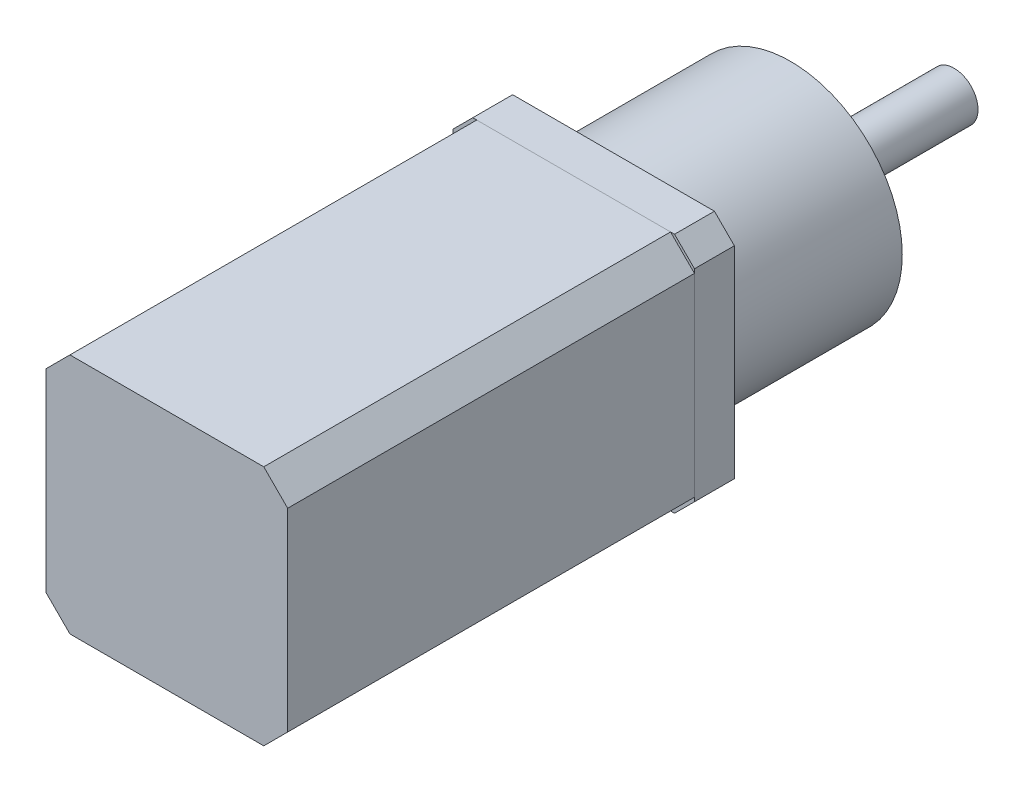
ISO-10303-21;
HEADER;
FILE_DESCRIPTION(('STEP AP214'),'2;1');
FILE_NAME('part.step','',(''),(''),'','','');
FILE_SCHEMA(('AUTOMOTIVE_DESIGN { 1 0 10303 214 1 1 1 1 }'));
ENDSEC;
DATA;
#1=APPLICATION_CONTEXT('core data for automotive mechanical design processes');
#2=APPLICATION_PROTOCOL_DEFINITION('international standard','automotive_design',2000,#1);
#3=PRODUCT_CONTEXT('',#1,'mechanical');
#4=PRODUCT('Part','Part','',(#3));
#5=PRODUCT_RELATED_PRODUCT_CATEGORY('part','',(#4));
#6=PRODUCT_DEFINITION_FORMATION('','',#4);
#7=PRODUCT_DEFINITION_CONTEXT('part definition',#1,'design');
#8=PRODUCT_DEFINITION('design','',#6,#7);
#9=PRODUCT_DEFINITION_SHAPE('','',#8);
#10=(LENGTH_UNIT() NAMED_UNIT(*) SI_UNIT(.MILLI.,.METRE.));
#11=(NAMED_UNIT(*) PLANE_ANGLE_UNIT() SI_UNIT($,.RADIAN.));
#12=(NAMED_UNIT(*) SI_UNIT($,.STERADIAN.) SOLID_ANGLE_UNIT());
#13=UNCERTAINTY_MEASURE_WITH_UNIT(LENGTH_MEASURE(1.E-05),#10,'distance_accuracy_value','');
#14=(GEOMETRIC_REPRESENTATION_CONTEXT(3) GLOBAL_UNCERTAINTY_ASSIGNED_CONTEXT((#13)) GLOBAL_UNIT_ASSIGNED_CONTEXT((#10,
#11,#12)) REPRESENTATION_CONTEXT('',''));
#15=CARTESIAN_POINT('',(0.,0.,0.));
#16=DIRECTION('',(0.,0.,1.));
#17=DIRECTION('',(1.,0.,0.));
#18=AXIS2_PLACEMENT_3D('',#15,#16,#17);
#19=CARTESIAN_POINT('',(-15.15,-15.15,-5.));
#20=DIRECTION('',(1.,0.,0.));
#21=DIRECTION('',(0.,0.,-1.));
#22=AXIS2_PLACEMENT_3D('',#19,#20,#21);
#23=PLANE('',#22);
#24=DIRECTION('',(0.,1.,0.));
#25=VECTOR('',#24,1.);
#26=CARTESIAN_POINT('',(-15.15,-15.15,-5.));
#27=LINE('',#26,#25);
#28=CARTESIAN_POINT('',(-15.15,-12.65,-5.));
#29=VERTEX_POINT('',#28);
#30=CARTESIAN_POINT('',(-15.15,12.65,-5.));
#31=VERTEX_POINT('',#30);
#32=EDGE_CURVE('E139',#29,#31,#27,.T.);
#33=ORIENTED_EDGE('',*,*,#32,.F.);
#34=DIRECTION('',(0.,0.,1.));
#35=VECTOR('',#34,1.);
#36=CARTESIAN_POINT('',(-15.15,-12.65,-5.));
#37=LINE('',#36,#35);
#38=CARTESIAN_POINT('',(-15.15,-12.65,0.));
#39=VERTEX_POINT('',#38);
#40=EDGE_CURVE('E12',#29,#39,#37,.T.);
#41=ORIENTED_EDGE('',*,*,#40,.T.);
#42=DIRECTION('',(0.,1.,0.));
#43=VECTOR('',#42,1.);
#44=CARTESIAN_POINT('',(-15.15,-15.15,0.));
#45=LINE('',#44,#43);
#46=CARTESIAN_POINT('',(-15.15,12.65,0.));
#47=VERTEX_POINT('',#46);
#48=EDGE_CURVE('E141',#39,#47,#45,.T.);
#49=ORIENTED_EDGE('',*,*,#48,.T.);
#50=DIRECTION('',(0.,0.,-1.));
#51=VECTOR('',#50,1.);
#52=CARTESIAN_POINT('',(-15.15,12.65,-5.));
#53=LINE('',#52,#51);
#54=EDGE_CURVE('E52',#47,#31,#53,.T.);
#55=ORIENTED_EDGE('',*,*,#54,.T.);
#56=EDGE_LOOP('',(#33,#41,#49,#55));
#57=FACE_BOUND('',#56,.T.);
#58=ADVANCED_FACE('F44',(#57),#23,.F.);
#59=CARTESIAN_POINT('',(15.15,15.15,-5.));
#60=DIRECTION('',(0.,-1.,0.));
#61=DIRECTION('',(0.,0.,-1.));
#62=AXIS2_PLACEMENT_3D('',#59,#60,#61);
#63=PLANE('',#62);
#64=DIRECTION('',(1.,0.,0.));
#65=VECTOR('',#64,1.);
#66=CARTESIAN_POINT('',(15.15,15.15,0.));
#67=LINE('',#66,#65);
#68=CARTESIAN_POINT('',(-12.65,15.15,0.));
#69=VERTEX_POINT('',#68);
#70=CARTESIAN_POINT('',(12.65,15.15,0.));
#71=VERTEX_POINT('',#70);
#72=EDGE_CURVE('E137',#69,#71,#67,.T.);
#73=ORIENTED_EDGE('',*,*,#72,.T.);
#74=DIRECTION('',(0.,0.,-1.));
#75=VECTOR('',#74,1.);
#76=CARTESIAN_POINT('',(12.65,15.15,-5.));
#77=LINE('',#76,#75);
#78=CARTESIAN_POINT('',(12.65,15.15,-5.));
#79=VERTEX_POINT('',#78);
#80=EDGE_CURVE('E116',#71,#79,#77,.T.);
#81=ORIENTED_EDGE('',*,*,#80,.T.);
#82=DIRECTION('',(1.,0.,0.));
#83=VECTOR('',#82,1.);
#84=CARTESIAN_POINT('',(15.15,15.15,-5.));
#85=LINE('',#84,#83);
#86=CARTESIAN_POINT('',(-12.65,15.15,-5.));
#87=VERTEX_POINT('',#86);
#88=EDGE_CURVE('E185',#87,#79,#85,.T.);
#89=ORIENTED_EDGE('',*,*,#88,.F.);
#90=DIRECTION('',(0.,0.,1.));
#91=VECTOR('',#90,1.);
#92=CARTESIAN_POINT('',(-12.65,15.15,-5.));
#93=LINE('',#92,#91);
#94=EDGE_CURVE('E121',#87,#69,#93,.T.);
#95=ORIENTED_EDGE('',*,*,#94,.T.);
#96=EDGE_LOOP('',(#73,#81,#89,#95));
#97=FACE_BOUND('',#96,.T.);
#98=ADVANCED_FACE('F189',(#97),#63,.F.);
#99=CARTESIAN_POINT('',(15.15,-15.15,-5.));
#100=DIRECTION('',(-1.,0.,0.));
#101=DIRECTION('',(0.,0.,1.));
#102=AXIS2_PLACEMENT_3D('',#99,#100,#101);
#103=PLANE('',#102);
#104=DIRECTION('',(0.,-1.,0.));
#105=VECTOR('',#104,1.);
#106=CARTESIAN_POINT('',(15.15,-15.15,-5.));
#107=LINE('',#106,#105);
#108=CARTESIAN_POINT('',(15.15,12.65,-5.));
#109=VERTEX_POINT('',#108);
#110=CARTESIAN_POINT('',(15.15,-12.65,-5.));
#111=VERTEX_POINT('',#110);
#112=EDGE_CURVE('E130',#109,#111,#107,.T.);
#113=ORIENTED_EDGE('',*,*,#112,.F.);
#114=DIRECTION('',(0.,0.,1.));
#115=VECTOR('',#114,1.);
#116=CARTESIAN_POINT('',(15.15,12.65,-5.));
#117=LINE('',#116,#115);
#118=CARTESIAN_POINT('',(15.15,12.65,0.));
#119=VERTEX_POINT('',#118);
#120=EDGE_CURVE('E115',#109,#119,#117,.T.);
#121=ORIENTED_EDGE('',*,*,#120,.T.);
#122=DIRECTION('',(0.,-1.,0.));
#123=VECTOR('',#122,1.);
#124=CARTESIAN_POINT('',(15.15,-15.15,0.));
#125=LINE('',#124,#123);
#126=CARTESIAN_POINT('',(15.15,-12.65,0.));
#127=VERTEX_POINT('',#126);
#128=EDGE_CURVE('E128',#119,#127,#125,.T.);
#129=ORIENTED_EDGE('',*,*,#128,.T.);
#130=DIRECTION('',(0.,0.,-1.));
#131=VECTOR('',#130,1.);
#132=CARTESIAN_POINT('',(15.15,-12.65,-5.));
#133=LINE('',#132,#131);
#134=EDGE_CURVE('E132',#127,#111,#133,.T.);
#135=ORIENTED_EDGE('',*,*,#134,.T.);
#136=EDGE_LOOP('',(#113,#121,#129,#135));
#137=FACE_BOUND('',#136,.T.);
#138=ADVANCED_FACE('F127',(#137),#103,.F.);
#139=CARTESIAN_POINT('',(15.15,-15.15,-5.));
#140=DIRECTION('',(0.,1.,0.));
#141=DIRECTION('',(0.,0.,1.));
#142=AXIS2_PLACEMENT_3D('',#139,#140,#141);
#143=PLANE('',#142);
#144=DIRECTION('',(-1.,0.,0.));
#145=VECTOR('',#144,1.);
#146=CARTESIAN_POINT('',(15.15,-15.15,-5.));
#147=LINE('',#146,#145);
#148=CARTESIAN_POINT('',(12.65,-15.15,-5.));
#149=VERTEX_POINT('',#148);
#150=CARTESIAN_POINT('',(-12.65,-15.15,-5.));
#151=VERTEX_POINT('',#150);
#152=EDGE_CURVE('E148',#149,#151,#147,.T.);
#153=ORIENTED_EDGE('',*,*,#152,.F.);
#154=DIRECTION('',(0.,0.,1.));
#155=VECTOR('',#154,1.);
#156=CARTESIAN_POINT('',(12.65,-15.15,-5.));
#157=LINE('',#156,#155);
#158=CARTESIAN_POINT('',(12.65,-15.15,0.));
#159=VERTEX_POINT('',#158);
#160=EDGE_CURVE('E170',#149,#159,#157,.T.);
#161=ORIENTED_EDGE('',*,*,#160,.T.);
#162=DIRECTION('',(-1.,0.,0.));
#163=VECTOR('',#162,1.);
#164=CARTESIAN_POINT('',(15.15,-15.15,0.));
#165=LINE('',#164,#163);
#166=CARTESIAN_POINT('',(-12.65,-15.15,0.));
#167=VERTEX_POINT('',#166);
#168=EDGE_CURVE('E136',#159,#167,#165,.T.);
#169=ORIENTED_EDGE('',*,*,#168,.T.);
#170=DIRECTION('',(0.,0.,-1.));
#171=VECTOR('',#170,1.);
#172=CARTESIAN_POINT('',(-12.65,-15.15,-5.));
#173=LINE('',#172,#171);
#174=EDGE_CURVE('E59',#167,#151,#173,.T.);
#175=ORIENTED_EDGE('',*,*,#174,.T.);
#176=EDGE_LOOP('',(#153,#161,#169,#175));
#177=FACE_BOUND('',#176,.T.);
#178=ADVANCED_FACE('F244',(#177),#143,.F.);
#179=CARTESIAN_POINT('',(0.,0.,-5.));
#180=DIRECTION('',(0.,0.,1.));
#181=DIRECTION('',(1.,0.,0.));
#182=AXIS2_PLACEMENT_3D('',#179,#180,#181);
#183=PLANE('',#182);
#184=CARTESIAN_POINT('',(0.,0.,-5.));
#185=DIRECTION('',(0.,0.,1.));
#186=DIRECTION('',(1.,0.,0.));
#187=AXIS2_PLACEMENT_3D('',#184,#185,#186);
#188=CIRCLE('',#187,14.);
#189=CARTESIAN_POINT('',(14.,0.,-5.));
#190=VERTEX_POINT('',#189);
#191=EDGE_CURVE('E145',#190,#190,#188,.F.);
#192=ORIENTED_EDGE('',*,*,#191,.F.);
#193=EDGE_LOOP('',(#192));
#194=FACE_BOUND('',#193,.T.);
#195=ORIENTED_EDGE('',*,*,#88,.T.);
#196=DIRECTION('',(-0.707106781186548,0.707106781186548,0.));
#197=VECTOR('',#196,1.);
#198=CARTESIAN_POINT('',(15.15,12.65,-5.));
#199=LINE('',#198,#197);
#200=EDGE_CURVE('E167',#79,#109,#199,.F.);
#201=ORIENTED_EDGE('',*,*,#200,.T.);
#202=ORIENTED_EDGE('',*,*,#112,.T.);
#203=DIRECTION('',(0.707106781186548,0.707106781186548,0.));
#204=VECTOR('',#203,1.);
#205=CARTESIAN_POINT('',(12.65,-15.15,-5.));
#206=LINE('',#205,#204);
#207=EDGE_CURVE('E66',#111,#149,#206,.F.);
#208=ORIENTED_EDGE('',*,*,#207,.T.);
#209=ORIENTED_EDGE('',*,*,#152,.T.);
#210=DIRECTION('',(0.707106781186548,-0.707106781186548,0.));
#211=VECTOR('',#210,1.);
#212=CARTESIAN_POINT('',(-15.15,-12.65,-5.));
#213=LINE('',#212,#211);
#214=EDGE_CURVE('E164',#151,#29,#213,.F.);
#215=ORIENTED_EDGE('',*,*,#214,.T.);
#216=ORIENTED_EDGE('',*,*,#32,.T.);
#217=DIRECTION('',(-0.707106781186548,-0.707106781186548,0.));
#218=VECTOR('',#217,1.);
#219=CARTESIAN_POINT('',(-12.65,15.15,-5.));
#220=LINE('',#219,#218);
#221=EDGE_CURVE('E162',#31,#87,#220,.F.);
#222=ORIENTED_EDGE('',*,*,#221,.T.);
#223=EDGE_LOOP('',(#195,#201,#202,#208,#209,#215,#216,#222));
#224=FACE_BOUND('',#223,.T.);
#225=ADVANCED_FACE('F182',(#194,#224),#183,.F.);
#226=CARTESIAN_POINT('',(0.,0.,0.));
#227=DIRECTION('',(0.,0.,1.));
#228=DIRECTION('',(1.,0.,0.));
#229=AXIS2_PLACEMENT_3D('',#226,#227,#228);
#230=PLANE('',#229);
#231=ORIENTED_EDGE('',*,*,#128,.F.);
#232=DIRECTION('',(0.707106781186548,-0.707106781186548,0.));
#233=VECTOR('',#232,1.);
#234=CARTESIAN_POINT('',(13.9,13.9,0.));
#235=LINE('',#234,#233);
#236=EDGE_CURVE('E111',#119,#71,#235,.F.);
#237=ORIENTED_EDGE('',*,*,#236,.T.);
#238=ORIENTED_EDGE('',*,*,#72,.F.);
#239=DIRECTION('',(0.707106781186548,0.707106781186548,0.));
#240=VECTOR('',#239,1.);
#241=CARTESIAN_POINT('',(-13.9,13.9,0.));
#242=LINE('',#241,#240);
#243=EDGE_CURVE('E131',#69,#47,#242,.F.);
#244=ORIENTED_EDGE('',*,*,#243,.T.);
#245=ORIENTED_EDGE('',*,*,#48,.F.);
#246=DIRECTION('',(-0.707106781186548,0.707106781186548,0.));
#247=VECTOR('',#246,1.);
#248=CARTESIAN_POINT('',(-13.9,-13.9,0.));
#249=LINE('',#248,#247);
#250=EDGE_CURVE('E156',#39,#167,#249,.F.);
#251=ORIENTED_EDGE('',*,*,#250,.T.);
#252=ORIENTED_EDGE('',*,*,#168,.F.);
#253=DIRECTION('',(-0.707106781186548,-0.707106781186548,0.));
#254=VECTOR('',#253,1.);
#255=CARTESIAN_POINT('',(13.9,-13.9,0.));
#256=LINE('',#255,#254);
#257=EDGE_CURVE('E122',#159,#127,#256,.F.);
#258=ORIENTED_EDGE('',*,*,#257,.T.);
#259=EDGE_LOOP('',(#231,#237,#238,#244,#245,#251,#252,#258));
#260=FACE_BOUND('',#259,.T.);
#261=ADVANCED_FACE('F134',(#260),#230,.T.);
#262=CARTESIAN_POINT('',(0.,0.,-27.2));
#263=DIRECTION('',(0.,0.,1.));
#264=DIRECTION('',(1.,0.,0.));
#265=AXIS2_PLACEMENT_3D('',#262,#263,#264);
#266=CYLINDRICAL_SURFACE('',#265,14.);
#267=CARTESIAN_POINT('',(0.,0.,-27.2));
#268=DIRECTION('',(0.,0.,-1.));
#269=DIRECTION('',(-1.,0.,0.));
#270=AXIS2_PLACEMENT_3D('',#267,#268,#269);
#271=CIRCLE('',#270,14.);
#272=CARTESIAN_POINT('',(-14.,0.,-27.2));
#273=VERTEX_POINT('',#272);
#274=EDGE_CURVE('E190',#273,#273,#271,.T.);
#275=ORIENTED_EDGE('',*,*,#274,.F.);
#276=EDGE_LOOP('',(#275));
#277=FACE_BOUND('',#276,.T.);
#278=ORIENTED_EDGE('',*,*,#191,.T.);
#279=EDGE_LOOP('',(#278));
#280=FACE_BOUND('',#279,.T.);
#281=ADVANCED_FACE('F234',(#277,#280),#266,.T.);
#282=CARTESIAN_POINT('',(0.,0.,-27.2));
#283=DIRECTION('',(0.,0.,-1.));
#284=DIRECTION('',(-1.,0.,0.));
#285=AXIS2_PLACEMENT_3D('',#282,#283,#284);
#286=PLANE('',#285);
#287=CARTESIAN_POINT('',(0.,0.,-27.2));
#288=DIRECTION('',(0.,0.,-1.));
#289=DIRECTION('',(-1.,0.,0.));
#290=AXIS2_PLACEMENT_3D('',#287,#288,#289);
#291=CIRCLE('',#290,9.);
#292=CARTESIAN_POINT('',(-9.,0.,-27.2));
#293=VERTEX_POINT('',#292);
#294=EDGE_CURVE('E198',#293,#293,#291,.T.);
#295=ORIENTED_EDGE('',*,*,#294,.F.);
#296=EDGE_LOOP('',(#295));
#297=FACE_BOUND('',#296,.T.);
#298=ORIENTED_EDGE('',*,*,#274,.T.);
#299=EDGE_LOOP('',(#298));
#300=FACE_BOUND('',#299,.T.);
#301=ADVANCED_FACE('F228',(#297,#300),#286,.T.);
#302=CARTESIAN_POINT('',(0.,0.,-29.2));
#303=DIRECTION('',(0.,0.,1.));
#304=DIRECTION('',(1.,0.,0.));
#305=AXIS2_PLACEMENT_3D('',#302,#303,#304);
#306=CYLINDRICAL_SURFACE('',#305,9.);
#307=CARTESIAN_POINT('',(0.,0.,-29.2));
#308=DIRECTION('',(0.,0.,-1.));
#309=DIRECTION('',(-1.,0.,0.));
#310=AXIS2_PLACEMENT_3D('',#307,#308,#309);
#311=CIRCLE('',#310,9.);
#312=CARTESIAN_POINT('',(-9.,0.,-29.2));
#313=VERTEX_POINT('',#312);
#314=EDGE_CURVE('E192',#313,#313,#311,.T.);
#315=ORIENTED_EDGE('',*,*,#314,.F.);
#316=EDGE_LOOP('',(#315));
#317=FACE_BOUND('',#316,.T.);
#318=ORIENTED_EDGE('',*,*,#294,.T.);
#319=EDGE_LOOP('',(#318));
#320=FACE_BOUND('',#319,.T.);
#321=ADVANCED_FACE('F222',(#317,#320),#306,.T.);
#322=CARTESIAN_POINT('',(0.,0.,-29.2));
#323=DIRECTION('',(0.,0.,-1.));
#324=DIRECTION('',(-1.,0.,0.));
#325=AXIS2_PLACEMENT_3D('',#322,#323,#324);
#326=PLANE('',#325);
#327=CARTESIAN_POINT('',(0.,0.,-29.2));
#328=DIRECTION('',(0.,0.,-1.));
#329=DIRECTION('',(-1.,0.,0.));
#330=AXIS2_PLACEMENT_3D('',#327,#328,#329);
#331=CIRCLE('',#330,4.32234312039916);
#332=CARTESIAN_POINT('',(-4.32234312039916,0.,-29.2));
#333=VERTEX_POINT('',#332);
#334=EDGE_CURVE('E205',#333,#333,#331,.T.);
#335=ORIENTED_EDGE('',*,*,#334,.F.);
#336=EDGE_LOOP('',(#335));
#337=FACE_BOUND('',#336,.T.);
#338=ORIENTED_EDGE('',*,*,#314,.T.);
#339=EDGE_LOOP('',(#338));
#340=FACE_BOUND('',#339,.T.);
#341=ADVANCED_FACE('F216',(#337,#340),#326,.T.);
#342=CARTESIAN_POINT('',(0.,0.,-29.6));
#343=DIRECTION('',(0.,0.,1.));
#344=DIRECTION('',(1.,0.,0.));
#345=AXIS2_PLACEMENT_3D('',#342,#343,#344);
#346=CYLINDRICAL_SURFACE('',#345,4.32234312039916);
#347=CARTESIAN_POINT('',(0.,0.,-29.6));
#348=DIRECTION('',(0.,0.,-1.));
#349=DIRECTION('',(-1.,0.,0.));
#350=AXIS2_PLACEMENT_3D('',#347,#348,#349);
#351=CIRCLE('',#350,4.32234312039916);
#352=CARTESIAN_POINT('',(-4.32234312039916,0.,-29.6));
#353=VERTEX_POINT('',#352);
#354=EDGE_CURVE('E153',#353,#353,#351,.T.);
#355=ORIENTED_EDGE('',*,*,#354,.F.);
#356=EDGE_LOOP('',(#355));
#357=FACE_BOUND('',#356,.T.);
#358=ORIENTED_EDGE('',*,*,#334,.T.);
#359=EDGE_LOOP('',(#358));
#360=FACE_BOUND('',#359,.T.);
#361=ADVANCED_FACE('F213',(#357,#360),#346,.T.);
#362=CARTESIAN_POINT('',(0.,0.,-29.6));
#363=DIRECTION('',(0.,0.,-1.));
#364=DIRECTION('',(-1.,0.,0.));
#365=AXIS2_PLACEMENT_3D('',#362,#363,#364);
#366=PLANE('',#365);
#367=CARTESIAN_POINT('',(0.,0.,-29.6));
#368=DIRECTION('',(0.,0.,-1.));
#369=DIRECTION('',(-1.,0.,0.));
#370=AXIS2_PLACEMENT_3D('',#367,#368,#369);
#371=CIRCLE('',#370,3.);
#372=CARTESIAN_POINT('',(-3.,0.,-29.6));
#373=VERTEX_POINT('',#372);
#374=EDGE_CURVE('E149',#373,#373,#371,.T.);
#375=ORIENTED_EDGE('',*,*,#374,.F.);
#376=EDGE_LOOP('',(#375));
#377=FACE_BOUND('',#376,.T.);
#378=ORIENTED_EDGE('',*,*,#354,.T.);
#379=EDGE_LOOP('',(#378));
#380=FACE_BOUND('',#379,.T.);
#381=ADVANCED_FACE('F211',(#377,#380),#366,.T.);
#382=CARTESIAN_POINT('',(0.,0.,-47.7));
#383=DIRECTION('',(0.,0.,-1.));
#384=DIRECTION('',(-1.,0.,0.));
#385=AXIS2_PLACEMENT_3D('',#382,#383,#384);
#386=PLANE('',#385);
#387=CARTESIAN_POINT('',(0.,0.,-47.7));
#388=DIRECTION('',(0.,0.,-1.));
#389=DIRECTION('',(-1.,0.,0.));
#390=AXIS2_PLACEMENT_3D('',#387,#388,#389);
#391=CIRCLE('',#390,3.);
#392=CARTESIAN_POINT('',(-3.,0.,-47.7));
#393=VERTEX_POINT('',#392);
#394=EDGE_CURVE('E152',#393,#393,#391,.T.);
#395=ORIENTED_EDGE('',*,*,#394,.T.);
#396=EDGE_LOOP('',(#395));
#397=FACE_BOUND('',#396,.T.);
#398=ADVANCED_FACE('F334',(#397),#386,.T.);
#399=CARTESIAN_POINT('',(0.,0.,-47.7));
#400=DIRECTION('',(0.,0.,1.));
#401=DIRECTION('',(1.,0.,0.));
#402=AXIS2_PLACEMENT_3D('',#399,#400,#401);
#403=CYLINDRICAL_SURFACE('',#402,3.);
#404=ORIENTED_EDGE('',*,*,#374,.T.);
#405=EDGE_LOOP('',(#404));
#406=FACE_BOUND('',#405,.T.);
#407=ORIENTED_EDGE('',*,*,#394,.F.);
#408=EDGE_LOOP('',(#407));
#409=FACE_BOUND('',#408,.T.);
#410=ADVANCED_FACE('F263',(#406,#409),#403,.T.);
#411=CARTESIAN_POINT('',(15.15,12.65,-5.));
#412=DIRECTION('',(-0.707106781186547,-0.707106781186547,0.));
#413=DIRECTION('',(0.,0.,1.));
#414=AXIS2_PLACEMENT_3D('',#411,#412,#413);
#415=PLANE('',#414);
#416=ORIENTED_EDGE('',*,*,#200,.F.);
#417=ORIENTED_EDGE('',*,*,#80,.F.);
#418=ORIENTED_EDGE('',*,*,#236,.F.);
#419=ORIENTED_EDGE('',*,*,#120,.F.);
#420=EDGE_LOOP('',(#416,#417,#418,#419));
#421=FACE_BOUND('',#420,.T.);
#422=ADVANCED_FACE('F114',(#421),#415,.F.);
#423=CARTESIAN_POINT('',(12.65,-15.15,-5.));
#424=DIRECTION('',(-0.707106781186547,0.707106781186547,0.));
#425=DIRECTION('',(0.,0.,1.));
#426=AXIS2_PLACEMENT_3D('',#423,#424,#425);
#427=PLANE('',#426);
#428=ORIENTED_EDGE('',*,*,#207,.F.);
#429=ORIENTED_EDGE('',*,*,#134,.F.);
#430=ORIENTED_EDGE('',*,*,#257,.F.);
#431=ORIENTED_EDGE('',*,*,#160,.F.);
#432=EDGE_LOOP('',(#428,#429,#430,#431));
#433=FACE_BOUND('',#432,.T.);
#434=ADVANCED_FACE('F262',(#433),#427,.F.);
#435=CARTESIAN_POINT('',(-15.15,-12.65,-5.));
#436=DIRECTION('',(0.707106781186547,0.707106781186547,0.));
#437=DIRECTION('',(0.,0.,1.));
#438=AXIS2_PLACEMENT_3D('',#435,#436,#437);
#439=PLANE('',#438);
#440=ORIENTED_EDGE('',*,*,#214,.F.);
#441=ORIENTED_EDGE('',*,*,#174,.F.);
#442=ORIENTED_EDGE('',*,*,#250,.F.);
#443=ORIENTED_EDGE('',*,*,#40,.F.);
#444=EDGE_LOOP('',(#440,#441,#442,#443));
#445=FACE_BOUND('',#444,.T.);
#446=ADVANCED_FACE('F265',(#445),#439,.F.);
#447=CARTESIAN_POINT('',(-12.65,15.15,-5.));
#448=DIRECTION('',(0.707106781186547,-0.707106781186547,0.));
#449=DIRECTION('',(0.,0.,1.));
#450=AXIS2_PLACEMENT_3D('',#447,#448,#449);
#451=PLANE('',#450);
#452=ORIENTED_EDGE('',*,*,#221,.F.);
#453=ORIENTED_EDGE('',*,*,#54,.F.);
#454=ORIENTED_EDGE('',*,*,#243,.F.);
#455=ORIENTED_EDGE('',*,*,#94,.F.);
#456=EDGE_LOOP('',(#452,#453,#454,#455));
#457=FACE_BOUND('',#456,.T.);
#458=ADVANCED_FACE('F46',(#457),#451,.F.);
#459=CLOSED_SHELL('',(#58,#98,#138,#178,#225,#261,#281,#301,#321,#341,#361,#381,#398,#410,#422,
#434,#446,#458));
#460=MANIFOLD_SOLID_BREP('B2',#459);
#461=CARTESIAN_POINT('',(15.15,15.15,51.));
#462=DIRECTION('',(-1.,0.,0.));
#463=DIRECTION('',(0.,-1.,0.));
#464=AXIS2_PLACEMENT_3D('',#461,#462,#463);
#465=PLANE('',#464);
#466=DIRECTION('',(0.,1.,0.));
#467=VECTOR('',#466,1.);
#468=CARTESIAN_POINT('',(15.15,15.15,51.));
#469=LINE('',#468,#467);
#470=CARTESIAN_POINT('',(15.15,-12.15,51.));
#471=VERTEX_POINT('',#470);
#472=CARTESIAN_POINT('',(15.15,12.15,51.));
#473=VERTEX_POINT('',#472);
#474=EDGE_CURVE('E484',#471,#473,#469,.T.);
#475=ORIENTED_EDGE('',*,*,#474,.F.);
#476=DIRECTION('',(0.,0.,-1.));
#477=VECTOR('',#476,1.);
#478=CARTESIAN_POINT('',(15.15,-12.15,51.));
#479=LINE('',#478,#477);
#480=CARTESIAN_POINT('',(15.15,-12.15,0.));
#481=VERTEX_POINT('',#480);
#482=EDGE_CURVE('E510',#471,#481,#479,.T.);
#483=ORIENTED_EDGE('',*,*,#482,.T.);
#484=DIRECTION('',(0.,1.,0.));
#485=VECTOR('',#484,1.);
#486=CARTESIAN_POINT('',(15.15,15.15,0.));
#487=LINE('',#486,#485);
#488=CARTESIAN_POINT('',(15.15,12.15,0.));
#489=VERTEX_POINT('',#488);
#490=EDGE_CURVE('E518',#481,#489,#487,.T.);
#491=ORIENTED_EDGE('',*,*,#490,.T.);
#492=DIRECTION('',(0.,0.,1.));
#493=VECTOR('',#492,1.);
#494=CARTESIAN_POINT('',(15.15,12.15,51.));
#495=LINE('',#494,#493);
#496=EDGE_CURVE('E508',#489,#473,#495,.T.);
#497=ORIENTED_EDGE('',*,*,#496,.T.);
#498=EDGE_LOOP('',(#475,#483,#491,#497));
#499=FACE_BOUND('',#498,.T.);
#500=ADVANCED_FACE('F393',(#499),#465,.F.);
#501=CARTESIAN_POINT('',(-15.15,15.15,51.));
#502=DIRECTION('',(0.,-1.,0.));
#503=DIRECTION('',(0.,0.,-1.));
#504=AXIS2_PLACEMENT_3D('',#501,#502,#503);
#505=PLANE('',#504);
#506=DIRECTION('',(-1.,0.,0.));
#507=VECTOR('',#506,1.);
#508=CARTESIAN_POINT('',(-15.15,15.15,0.));
#509=LINE('',#508,#507);
#510=CARTESIAN_POINT('',(12.15,15.15,0.));
#511=VERTEX_POINT('',#510);
#512=CARTESIAN_POINT('',(-12.15,15.15,0.));
#513=VERTEX_POINT('',#512);
#514=EDGE_CURVE('E489',#511,#513,#509,.T.);
#515=ORIENTED_EDGE('',*,*,#514,.T.);
#516=DIRECTION('',(0.,0.,1.));
#517=VECTOR('',#516,1.);
#518=CARTESIAN_POINT('',(-12.15,15.15,51.));
#519=LINE('',#518,#517);
#520=CARTESIAN_POINT('',(-12.15,15.15,51.));
#521=VERTEX_POINT('',#520);
#522=EDGE_CURVE('E42',#513,#521,#519,.T.);
#523=ORIENTED_EDGE('',*,*,#522,.T.);
#524=DIRECTION('',(-1.,0.,0.));
#525=VECTOR('',#524,1.);
#526=CARTESIAN_POINT('',(-15.15,15.15,51.));
#527=LINE('',#526,#525);
#528=CARTESIAN_POINT('',(12.15,15.15,51.));
#529=VERTEX_POINT('',#528);
#530=EDGE_CURVE('E487',#529,#521,#527,.T.);
#531=ORIENTED_EDGE('',*,*,#530,.F.);
#532=DIRECTION('',(0.,0.,-1.));
#533=VECTOR('',#532,1.);
#534=CARTESIAN_POINT('',(12.15,15.15,51.));
#535=LINE('',#534,#533);
#536=EDGE_CURVE('E401',#529,#511,#535,.T.);
#537=ORIENTED_EDGE('',*,*,#536,.T.);
#538=EDGE_LOOP('',(#515,#523,#531,#537));
#539=FACE_BOUND('',#538,.T.);
#540=ADVANCED_FACE('F515',(#539),#505,.F.);
#541=CARTESIAN_POINT('',(-15.15,15.15,51.));
#542=DIRECTION('',(1.,0.,0.));
#543=DIRECTION('',(0.,1.,0.));
#544=AXIS2_PLACEMENT_3D('',#541,#542,#543);
#545=PLANE('',#544);
#546=DIRECTION('',(0.,-1.,0.));
#547=VECTOR('',#546,1.);
#548=CARTESIAN_POINT('',(-15.15,15.15,0.));
#549=LINE('',#548,#547);
#550=CARTESIAN_POINT('',(-15.15,12.15,0.));
#551=VERTEX_POINT('',#550);
#552=CARTESIAN_POINT('',(-15.15,-12.15,0.));
#553=VERTEX_POINT('',#552);
#554=EDGE_CURVE('E485',#551,#553,#549,.T.);
#555=ORIENTED_EDGE('',*,*,#554,.T.);
#556=DIRECTION('',(0.,0.,1.));
#557=VECTOR('',#556,1.);
#558=CARTESIAN_POINT('',(-15.15,-12.15,51.));
#559=LINE('',#558,#557);
#560=CARTESIAN_POINT('',(-15.15,-12.15,51.));
#561=VERTEX_POINT('',#560);
#562=EDGE_CURVE('E463',#553,#561,#559,.T.);
#563=ORIENTED_EDGE('',*,*,#562,.T.);
#564=DIRECTION('',(0.,-1.,0.));
#565=VECTOR('',#564,1.);
#566=CARTESIAN_POINT('',(-15.15,15.15,51.));
#567=LINE('',#566,#565);
#568=CARTESIAN_POINT('',(-15.15,12.15,51.));
#569=VERTEX_POINT('',#568);
#570=EDGE_CURVE('E522',#569,#561,#567,.T.);
#571=ORIENTED_EDGE('',*,*,#570,.F.);
#572=DIRECTION('',(0.,0.,-1.));
#573=VECTOR('',#572,1.);
#574=CARTESIAN_POINT('',(-15.15,12.15,51.));
#575=LINE('',#574,#573);
#576=EDGE_CURVE('E468',#569,#551,#575,.T.);
#577=ORIENTED_EDGE('',*,*,#576,.T.);
#578=EDGE_LOOP('',(#555,#563,#571,#577));
#579=FACE_BOUND('',#578,.T.);
#580=ADVANCED_FACE('F532',(#579),#545,.F.);
#581=CARTESIAN_POINT('',(-15.15,-15.15,51.));
#582=DIRECTION('',(0.,1.,0.));
#583=DIRECTION('',(0.,0.,1.));
#584=AXIS2_PLACEMENT_3D('',#581,#582,#583);
#585=PLANE('',#584);
#586=DIRECTION('',(1.,0.,0.));
#587=VECTOR('',#586,1.);
#588=CARTESIAN_POINT('',(-15.15,-15.15,51.));
#589=LINE('',#588,#587);
#590=CARTESIAN_POINT('',(-12.15,-15.15,51.));
#591=VERTEX_POINT('',#590);
#592=CARTESIAN_POINT('',(12.15,-15.15,51.));
#593=VERTEX_POINT('',#592);
#594=EDGE_CURVE('E478',#591,#593,#589,.T.);
#595=ORIENTED_EDGE('',*,*,#594,.F.);
#596=DIRECTION('',(0.,0.,-1.));
#597=VECTOR('',#596,1.);
#598=CARTESIAN_POINT('',(-12.15,-15.15,51.));
#599=LINE('',#598,#597);
#600=CARTESIAN_POINT('',(-12.15,-15.15,0.));
#601=VERTEX_POINT('',#600);
#602=EDGE_CURVE('E462',#591,#601,#599,.T.);
#603=ORIENTED_EDGE('',*,*,#602,.T.);
#604=DIRECTION('',(1.,0.,0.));
#605=VECTOR('',#604,1.);
#606=CARTESIAN_POINT('',(-15.15,-15.15,0.));
#607=LINE('',#606,#605);
#608=CARTESIAN_POINT('',(12.15,-15.15,0.));
#609=VERTEX_POINT('',#608);
#610=EDGE_CURVE('E475',#601,#609,#607,.T.);
#611=ORIENTED_EDGE('',*,*,#610,.T.);
#612=DIRECTION('',(0.,0.,1.));
#613=VECTOR('',#612,1.);
#614=CARTESIAN_POINT('',(12.15,-15.15,51.));
#615=LINE('',#614,#613);
#616=EDGE_CURVE('E480',#609,#593,#615,.T.);
#617=ORIENTED_EDGE('',*,*,#616,.T.);
#618=EDGE_LOOP('',(#595,#603,#611,#617));
#619=FACE_BOUND('',#618,.T.);
#620=ADVANCED_FACE('F474',(#619),#585,.F.);
#621=CARTESIAN_POINT('',(0.,0.,51.));
#622=DIRECTION('',(0.,0.,1.));
#623=DIRECTION('',(1.,0.,0.));
#624=AXIS2_PLACEMENT_3D('',#621,#622,#623);
#625=PLANE('',#624);
#626=ORIENTED_EDGE('',*,*,#570,.T.);
#627=DIRECTION('',(-0.707106781186547,0.707106781186548,0.));
#628=VECTOR('',#627,1.);
#629=CARTESIAN_POINT('',(-13.65,-13.65,51.));
#630=LINE('',#629,#628);
#631=EDGE_CURVE('E506',#561,#591,#630,.F.);
#632=ORIENTED_EDGE('',*,*,#631,.T.);
#633=ORIENTED_EDGE('',*,*,#594,.T.);
#634=DIRECTION('',(-0.707106781186548,-0.707106781186547,0.));
#635=VECTOR('',#634,1.);
#636=CARTESIAN_POINT('',(13.65,-13.65,51.));
#637=LINE('',#636,#635);
#638=EDGE_CURVE('E504',#593,#471,#637,.F.);
#639=ORIENTED_EDGE('',*,*,#638,.T.);
#640=ORIENTED_EDGE('',*,*,#474,.T.);
#641=DIRECTION('',(0.707106781186547,-0.707106781186548,0.));
#642=VECTOR('',#641,1.);
#643=CARTESIAN_POINT('',(13.65,13.65,51.));
#644=LINE('',#643,#642);
#645=EDGE_CURVE('E413',#473,#529,#644,.F.);
#646=ORIENTED_EDGE('',*,*,#645,.T.);
#647=ORIENTED_EDGE('',*,*,#530,.T.);
#648=DIRECTION('',(0.707106781186548,0.707106781186547,0.));
#649=VECTOR('',#648,1.);
#650=CARTESIAN_POINT('',(-13.65,13.65,51.));
#651=LINE('',#650,#649);
#652=EDGE_CURVE('E502',#521,#569,#651,.F.);
#653=ORIENTED_EDGE('',*,*,#652,.T.);
#654=EDGE_LOOP('',(#626,#632,#633,#639,#640,#646,#647,#653));
#655=FACE_BOUND('',#654,.T.);
#656=ADVANCED_FACE('F526',(#655),#625,.T.);
#657=CARTESIAN_POINT('',(0.,0.,0.));
#658=DIRECTION('',(0.,0.,1.));
#659=DIRECTION('',(1.,0.,0.));
#660=AXIS2_PLACEMENT_3D('',#657,#658,#659);
#661=PLANE('',#660);
#662=ORIENTED_EDGE('',*,*,#610,.F.);
#663=DIRECTION('',(0.707106781186547,-0.707106781186548,0.));
#664=VECTOR('',#663,1.);
#665=CARTESIAN_POINT('',(-12.15,-15.15,0.));
#666=LINE('',#665,#664);
#667=EDGE_CURVE('E458',#601,#553,#666,.F.);
#668=ORIENTED_EDGE('',*,*,#667,.T.);
#669=ORIENTED_EDGE('',*,*,#554,.F.);
#670=DIRECTION('',(-0.707106781186548,-0.707106781186547,0.));
#671=VECTOR('',#670,1.);
#672=CARTESIAN_POINT('',(-15.15,12.15,0.));
#673=LINE('',#672,#671);
#674=EDGE_CURVE('E495',#551,#513,#673,.F.);
#675=ORIENTED_EDGE('',*,*,#674,.T.);
#676=ORIENTED_EDGE('',*,*,#514,.F.);
#677=DIRECTION('',(-0.707106781186547,0.707106781186548,0.));
#678=VECTOR('',#677,1.);
#679=CARTESIAN_POINT('',(12.15,15.15,0.));
#680=LINE('',#679,#678);
#681=EDGE_CURVE('E479',#511,#489,#680,.F.);
#682=ORIENTED_EDGE('',*,*,#681,.T.);
#683=ORIENTED_EDGE('',*,*,#490,.F.);
#684=DIRECTION('',(0.707106781186548,0.707106781186547,0.));
#685=VECTOR('',#684,1.);
#686=CARTESIAN_POINT('',(15.15,-12.15,0.));
#687=LINE('',#686,#685);
#688=EDGE_CURVE('E469',#481,#609,#687,.F.);
#689=ORIENTED_EDGE('',*,*,#688,.T.);
#690=EDGE_LOOP('',(#662,#668,#669,#675,#676,#682,#683,#689));
#691=FACE_BOUND('',#690,.T.);
#692=ADVANCED_FACE('F482',(#691),#661,.F.);
#693=CARTESIAN_POINT('',(-12.15,-15.15,51.));
#694=DIRECTION('',(0.707106781186548,0.707106781186547,0.));
#695=DIRECTION('',(0.,0.,-1.));
#696=AXIS2_PLACEMENT_3D('',#693,#694,#695);
#697=PLANE('',#696);
#698=ORIENTED_EDGE('',*,*,#631,.F.);
#699=ORIENTED_EDGE('',*,*,#562,.F.);
#700=ORIENTED_EDGE('',*,*,#667,.F.);
#701=ORIENTED_EDGE('',*,*,#602,.F.);
#702=EDGE_LOOP('',(#698,#699,#700,#701));
#703=FACE_BOUND('',#702,.T.);
#704=ADVANCED_FACE('F461',(#703),#697,.F.);
#705=CARTESIAN_POINT('',(15.15,-12.15,51.));
#706=DIRECTION('',(-0.707106781186547,0.707106781186548,0.));
#707=DIRECTION('',(0.,0.,-1.));
#708=AXIS2_PLACEMENT_3D('',#705,#706,#707);
#709=PLANE('',#708);
#710=ORIENTED_EDGE('',*,*,#638,.F.);
#711=ORIENTED_EDGE('',*,*,#616,.F.);
#712=ORIENTED_EDGE('',*,*,#688,.F.);
#713=ORIENTED_EDGE('',*,*,#482,.F.);
#714=EDGE_LOOP('',(#710,#711,#712,#713));
#715=FACE_BOUND('',#714,.T.);
#716=ADVANCED_FACE('F537',(#715),#709,.F.);
#717=CARTESIAN_POINT('',(-15.15,12.15,51.));
#718=DIRECTION('',(0.707106781186547,-0.707106781186548,0.));
#719=DIRECTION('',(0.,0.,-1.));
#720=AXIS2_PLACEMENT_3D('',#717,#718,#719);
#721=PLANE('',#720);
#722=ORIENTED_EDGE('',*,*,#652,.F.);
#723=ORIENTED_EDGE('',*,*,#522,.F.);
#724=ORIENTED_EDGE('',*,*,#674,.F.);
#725=ORIENTED_EDGE('',*,*,#576,.F.);
#726=EDGE_LOOP('',(#722,#723,#724,#725));
#727=FACE_BOUND('',#726,.T.);
#728=ADVANCED_FACE('F530',(#727),#721,.F.);
#729=CARTESIAN_POINT('',(12.15,15.15,51.));
#730=DIRECTION('',(-0.707106781186548,-0.707106781186547,0.));
#731=DIRECTION('',(0.,0.,-1.));
#732=AXIS2_PLACEMENT_3D('',#729,#730,#731);
#733=PLANE('',#732);
#734=ORIENTED_EDGE('',*,*,#645,.F.);
#735=ORIENTED_EDGE('',*,*,#496,.F.);
#736=ORIENTED_EDGE('',*,*,#681,.F.);
#737=ORIENTED_EDGE('',*,*,#536,.F.);
#738=EDGE_LOOP('',(#734,#735,#736,#737));
#739=FACE_BOUND('',#738,.T.);
#740=ADVANCED_FACE('F395',(#739),#733,.F.);
#741=CLOSED_SHELL('',(#500,#540,#580,#620,#656,#692,#704,#716,#728,#740));
#742=MANIFOLD_SOLID_BREP('B6',#741);
#743=ADVANCED_BREP_SHAPE_REPRESENTATION('',(#18,#460,#742),#14);
#744=SHAPE_DEFINITION_REPRESENTATION(#9,#743);
ENDSEC;
END-ISO-10303-21;
